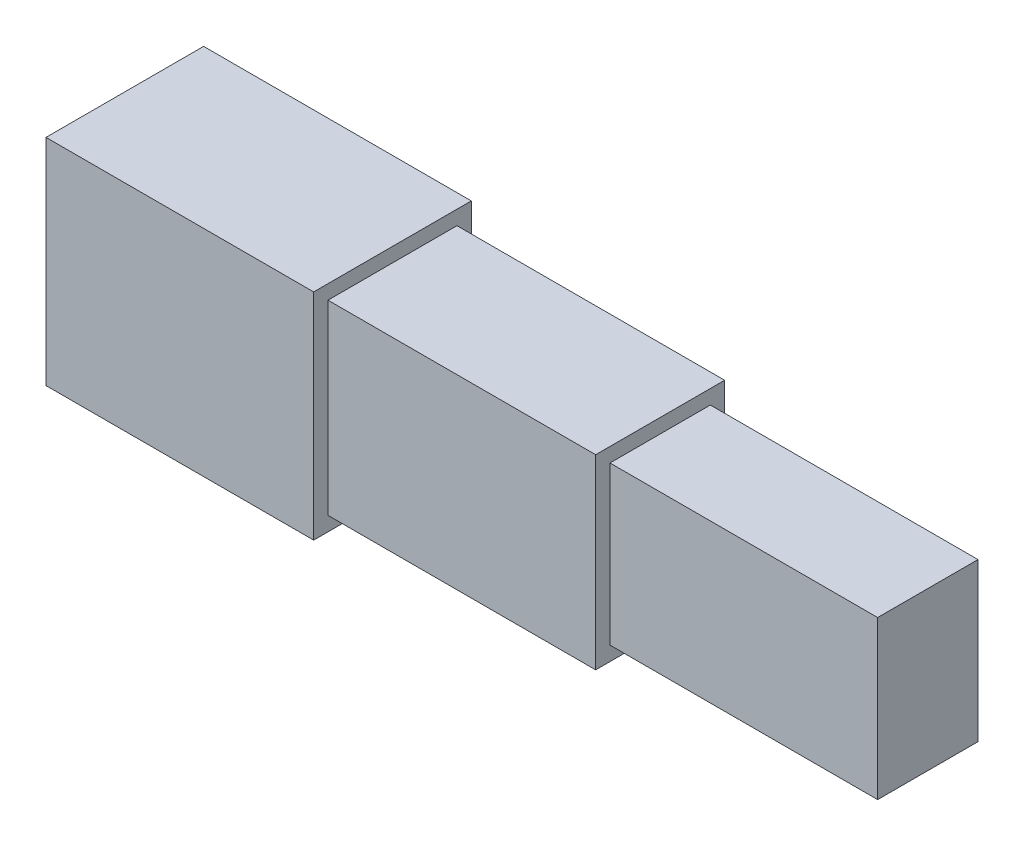
ISO-10303-21;
HEADER;
FILE_DESCRIPTION(('STEP AP214'),'2;1');
FILE_NAME('part.step','',(''),(''),'','','');
FILE_SCHEMA(('AUTOMOTIVE_DESIGN { 1 0 10303 214 1 1 1 1 }'));
ENDSEC;
DATA;
#1=APPLICATION_CONTEXT('core data for automotive mechanical design processes');
#2=APPLICATION_PROTOCOL_DEFINITION('international standard','automotive_design',2000,#1);
#3=PRODUCT_CONTEXT('',#1,'mechanical');
#4=PRODUCT('Part','Part','',(#3));
#5=PRODUCT_RELATED_PRODUCT_CATEGORY('part','',(#4));
#6=PRODUCT_DEFINITION_FORMATION('','',#4);
#7=PRODUCT_DEFINITION_CONTEXT('part definition',#1,'design');
#8=PRODUCT_DEFINITION('design','',#6,#7);
#9=PRODUCT_DEFINITION_SHAPE('','',#8);
#10=(LENGTH_UNIT() NAMED_UNIT(*) SI_UNIT(.MILLI.,.METRE.));
#11=(NAMED_UNIT(*) PLANE_ANGLE_UNIT() SI_UNIT($,.RADIAN.));
#12=(NAMED_UNIT(*) SI_UNIT($,.STERADIAN.) SOLID_ANGLE_UNIT());
#13=UNCERTAINTY_MEASURE_WITH_UNIT(LENGTH_MEASURE(1.E-05),#10,'distance_accuracy_value','');
#14=(GEOMETRIC_REPRESENTATION_CONTEXT(3) GLOBAL_UNCERTAINTY_ASSIGNED_CONTEXT((#13)) GLOBAL_UNIT_ASSIGNED_CONTEXT((#10,
#11,#12)) REPRESENTATION_CONTEXT('',''));
#15=CARTESIAN_POINT('',(0.,0.,0.));
#16=DIRECTION('',(0.,0.,1.));
#17=DIRECTION('',(1.,0.,0.));
#18=AXIS2_PLACEMENT_3D('',#15,#16,#17);
#19=CARTESIAN_POINT('',(1866.66666666667,0.,0.));
#20=DIRECTION('',(-1.,0.,0.));
#21=DIRECTION('',(0.,0.,1.));
#22=AXIS2_PLACEMENT_3D('',#19,#20,#21);
#23=PLANE('',#22);
#24=DIRECTION('',(0.,1.,0.));
#25=VECTOR('',#24,1.);
#26=CARTESIAN_POINT('',(1866.66666666667,-324.9,-224.9));
#27=LINE('',#26,#25);
#28=CARTESIAN_POINT('',(1866.66666666667,-324.9,-224.9));
#29=VERTEX_POINT('',#28);
#30=CARTESIAN_POINT('',(1866.66666666667,324.9,-224.9));
#31=VERTEX_POINT('',#30);
#32=EDGE_CURVE('E167',#29,#31,#27,.T.);
#33=ORIENTED_EDGE('',*,*,#32,.T.);
#34=DIRECTION('',(0.,0.,1.));
#35=VECTOR('',#34,1.);
#36=CARTESIAN_POINT('',(1866.66666666667,324.9,224.9));
#37=LINE('',#36,#35);
#38=CARTESIAN_POINT('',(1866.66666666667,324.9,224.9));
#39=VERTEX_POINT('',#38);
#40=EDGE_CURVE('E171',#31,#39,#37,.T.);
#41=ORIENTED_EDGE('',*,*,#40,.T.);
#42=DIRECTION('',(0.,-1.,0.));
#43=VECTOR('',#42,1.);
#44=CARTESIAN_POINT('',(1866.66666666667,-324.9,224.9));
#45=LINE('',#44,#43);
#46=CARTESIAN_POINT('',(1866.66666666667,-324.9,224.9));
#47=VERTEX_POINT('',#46);
#48=EDGE_CURVE('E175',#39,#47,#45,.T.);
#49=ORIENTED_EDGE('',*,*,#48,.T.);
#50=DIRECTION('',(0.,0.,-1.));
#51=VECTOR('',#50,1.);
#52=CARTESIAN_POINT('',(1866.66666666667,-324.9,224.9));
#53=LINE('',#52,#51);
#54=EDGE_CURVE('E178',#47,#29,#53,.T.);
#55=ORIENTED_EDGE('',*,*,#54,.T.);
#56=EDGE_LOOP('',(#33,#41,#49,#55));
#57=FACE_BOUND('',#56,.T.);
#58=DIRECTION('',(0.,1.,0.));
#59=VECTOR('',#58,1.);
#60=CARTESIAN_POINT('',(1866.66666666667,-274.9845,-174.9845));
#61=LINE('',#60,#59);
#62=CARTESIAN_POINT('',(1866.66666666667,-274.9845,-174.9845));
#63=VERTEX_POINT('',#62);
#64=CARTESIAN_POINT('',(1866.66666666667,274.9845,-174.9845));
#65=VERTEX_POINT('',#64);
#66=EDGE_CURVE('E59',#63,#65,#61,.T.);
#67=ORIENTED_EDGE('',*,*,#66,.F.);
#68=DIRECTION('',(0.,0.,-1.));
#69=VECTOR('',#68,1.);
#70=CARTESIAN_POINT('',(1866.66666666667,-274.9845,174.9845));
#71=LINE('',#70,#69);
#72=CARTESIAN_POINT('',(1866.66666666667,-274.9845,174.9845));
#73=VERTEX_POINT('',#72);
#74=EDGE_CURVE('E63',#73,#63,#71,.T.);
#75=ORIENTED_EDGE('',*,*,#74,.F.);
#76=DIRECTION('',(0.,-1.,0.));
#77=VECTOR('',#76,1.);
#78=CARTESIAN_POINT('',(1866.66666666667,-274.9845,174.9845));
#79=LINE('',#78,#77);
#80=CARTESIAN_POINT('',(1866.66666666667,274.9845,174.9845));
#81=VERTEX_POINT('',#80);
#82=EDGE_CURVE('E439',#81,#73,#79,.T.);
#83=ORIENTED_EDGE('',*,*,#82,.F.);
#84=DIRECTION('',(0.,0.,1.));
#85=VECTOR('',#84,1.);
#86=CARTESIAN_POINT('',(1866.66666666667,274.9845,174.9845));
#87=LINE('',#86,#85);
#88=EDGE_CURVE('E449',#65,#81,#87,.T.);
#89=ORIENTED_EDGE('',*,*,#88,.F.);
#90=EDGE_LOOP('',(#67,#75,#83,#89));
#91=FACE_BOUND('',#90,.T.);
#92=ADVANCED_FACE('F43',(#57,#91),#23,.F.);
#93=CARTESIAN_POINT('',(933.333333333333,0.,0.));
#94=DIRECTION('',(-1.,0.,0.));
#95=DIRECTION('',(0.,0.,1.));
#96=AXIS2_PLACEMENT_3D('',#93,#94,#95);
#97=PLANE('',#96);
#98=DIRECTION('',(0.,1.,0.));
#99=VECTOR('',#98,1.);
#100=CARTESIAN_POINT('',(933.333333333333,-374.8155,-274.8155));
#101=LINE('',#100,#99);
#102=CARTESIAN_POINT('',(933.333333333333,-374.8155,-274.8155));
#103=VERTEX_POINT('',#102);
#104=CARTESIAN_POINT('',(933.333333333333,374.8155,-274.8155));
#105=VERTEX_POINT('',#104);
#106=EDGE_CURVE('E208',#103,#105,#101,.T.);
#107=ORIENTED_EDGE('',*,*,#106,.T.);
#108=DIRECTION('',(0.,0.,1.));
#109=VECTOR('',#108,1.);
#110=CARTESIAN_POINT('',(933.333333333333,374.8155,274.8155));
#111=LINE('',#110,#109);
#112=CARTESIAN_POINT('',(933.333333333333,374.8155,274.8155));
#113=VERTEX_POINT('',#112);
#114=EDGE_CURVE('E212',#105,#113,#111,.T.);
#115=ORIENTED_EDGE('',*,*,#114,.T.);
#116=DIRECTION('',(0.,-1.,0.));
#117=VECTOR('',#116,1.);
#118=CARTESIAN_POINT('',(933.333333333333,-374.8155,274.8155));
#119=LINE('',#118,#117);
#120=CARTESIAN_POINT('',(933.333333333333,-374.8155,274.8155));
#121=VERTEX_POINT('',#120);
#122=EDGE_CURVE('E216',#113,#121,#119,.T.);
#123=ORIENTED_EDGE('',*,*,#122,.T.);
#124=DIRECTION('',(0.,0.,-1.));
#125=VECTOR('',#124,1.);
#126=CARTESIAN_POINT('',(933.333333333333,-374.8155,274.8155));
#127=LINE('',#126,#125);
#128=EDGE_CURVE('E219',#121,#103,#127,.T.);
#129=ORIENTED_EDGE('',*,*,#128,.T.);
#130=EDGE_LOOP('',(#107,#115,#123,#129));
#131=FACE_BOUND('',#130,.T.);
#132=DIRECTION('',(0.,1.,0.));
#133=VECTOR('',#132,1.);
#134=CARTESIAN_POINT('',(933.333333333333,-324.9,-224.9));
#135=LINE('',#134,#133);
#136=CARTESIAN_POINT('',(933.333333333333,-324.9,-224.9));
#137=VERTEX_POINT('',#136);
#138=CARTESIAN_POINT('',(933.333333333333,324.9,-224.9));
#139=VERTEX_POINT('',#138);
#140=EDGE_CURVE('E156',#137,#139,#135,.T.);
#141=ORIENTED_EDGE('',*,*,#140,.F.);
#142=DIRECTION('',(0.,0.,-1.));
#143=VECTOR('',#142,1.);
#144=CARTESIAN_POINT('',(933.333333333333,-324.9,224.9));
#145=LINE('',#144,#143);
#146=CARTESIAN_POINT('',(933.333333333333,-324.9,224.9));
#147=VERTEX_POINT('',#146);
#148=EDGE_CURVE('E172',#147,#137,#145,.T.);
#149=ORIENTED_EDGE('',*,*,#148,.F.);
#150=DIRECTION('',(0.,-1.,0.));
#151=VECTOR('',#150,1.);
#152=CARTESIAN_POINT('',(933.333333333333,-324.9,224.9));
#153=LINE('',#152,#151);
#154=CARTESIAN_POINT('',(933.333333333333,324.9,224.9));
#155=VERTEX_POINT('',#154);
#156=EDGE_CURVE('E185',#155,#147,#153,.T.);
#157=ORIENTED_EDGE('',*,*,#156,.F.);
#158=DIRECTION('',(0.,0.,1.));
#159=VECTOR('',#158,1.);
#160=CARTESIAN_POINT('',(933.333333333333,324.9,224.9));
#161=LINE('',#160,#159);
#162=EDGE_CURVE('E161',#139,#155,#161,.T.);
#163=ORIENTED_EDGE('',*,*,#162,.F.);
#164=EDGE_LOOP('',(#141,#149,#157,#163));
#165=FACE_BOUND('',#164,.T.);
#166=ADVANCED_FACE('F261',(#131,#165),#97,.F.);
#167=CARTESIAN_POINT('',(933.333333333333,-374.8155,-274.8155));
#168=DIRECTION('',(0.,0.,1.));
#169=DIRECTION('',(1.,0.,0.));
#170=AXIS2_PLACEMENT_3D('',#167,#168,#169);
#171=PLANE('',#170);
#172=DIRECTION('',(0.,1.,0.));
#173=VECTOR('',#172,1.);
#174=CARTESIAN_POINT('',(0.,-374.8155,-274.8155));
#175=LINE('',#174,#173);
#176=CARTESIAN_POINT('',(0.,-374.8155,-274.8155));
#177=VERTEX_POINT('',#176);
#178=CARTESIAN_POINT('',(0.,374.8155,-274.8155));
#179=VERTEX_POINT('',#178);
#180=EDGE_CURVE('E207',#177,#179,#175,.T.);
#181=ORIENTED_EDGE('',*,*,#180,.T.);
#182=DIRECTION('',(-1.,0.,0.));
#183=VECTOR('',#182,1.);
#184=CARTESIAN_POINT('',(933.333333333333,374.8155,-274.8155));
#185=LINE('',#184,#183);
#186=EDGE_CURVE('E11',#105,#179,#185,.T.);
#187=ORIENTED_EDGE('',*,*,#186,.F.);
#188=ORIENTED_EDGE('',*,*,#106,.F.);
#189=DIRECTION('',(-1.,0.,0.));
#190=VECTOR('',#189,1.);
#191=CARTESIAN_POINT('',(933.333333333333,-374.8155,-274.8155));
#192=LINE('',#191,#190);
#193=EDGE_CURVE('E222',#103,#177,#192,.T.);
#194=ORIENTED_EDGE('',*,*,#193,.T.);
#195=EDGE_LOOP('',(#181,#187,#188,#194));
#196=FACE_BOUND('',#195,.T.);
#197=ADVANCED_FACE('F45',(#196),#171,.F.);
#198=CARTESIAN_POINT('',(933.333333333333,374.8155,274.8155));
#199=DIRECTION('',(0.,-1.,0.));
#200=DIRECTION('',(0.,0.,-1.));
#201=AXIS2_PLACEMENT_3D('',#198,#199,#200);
#202=PLANE('',#201);
#203=DIRECTION('',(0.,0.,1.));
#204=VECTOR('',#203,1.);
#205=CARTESIAN_POINT('',(0.,374.8155,274.8155));
#206=LINE('',#205,#204);
#207=CARTESIAN_POINT('',(0.,374.8155,274.8155));
#208=VERTEX_POINT('',#207);
#209=EDGE_CURVE('E226',#179,#208,#206,.T.);
#210=ORIENTED_EDGE('',*,*,#209,.T.);
#211=DIRECTION('',(-1.,0.,0.));
#212=VECTOR('',#211,1.);
#213=CARTESIAN_POINT('',(933.333333333333,374.8155,274.8155));
#214=LINE('',#213,#212);
#215=EDGE_CURVE('E52',#113,#208,#214,.T.);
#216=ORIENTED_EDGE('',*,*,#215,.F.);
#217=ORIENTED_EDGE('',*,*,#114,.F.);
#218=ORIENTED_EDGE('',*,*,#186,.T.);
#219=EDGE_LOOP('',(#210,#216,#217,#218));
#220=FACE_BOUND('',#219,.T.);
#221=ADVANCED_FACE('F263',(#220),#202,.F.);
#222=CARTESIAN_POINT('',(933.333333333333,-374.8155,274.8155));
#223=DIRECTION('',(0.,0.,-1.));
#224=DIRECTION('',(-1.,0.,0.));
#225=AXIS2_PLACEMENT_3D('',#222,#223,#224);
#226=PLANE('',#225);
#227=DIRECTION('',(0.,-1.,0.));
#228=VECTOR('',#227,1.);
#229=CARTESIAN_POINT('',(0.,-374.8155,274.8155));
#230=LINE('',#229,#228);
#231=CARTESIAN_POINT('',(0.,-374.8155,274.8155));
#232=VERTEX_POINT('',#231);
#233=EDGE_CURVE('E229',#208,#232,#230,.T.);
#234=ORIENTED_EDGE('',*,*,#233,.T.);
#235=DIRECTION('',(-1.,0.,0.));
#236=VECTOR('',#235,1.);
#237=CARTESIAN_POINT('',(933.333333333333,-374.8155,274.8155));
#238=LINE('',#237,#236);
#239=EDGE_CURVE('E237',#121,#232,#238,.T.);
#240=ORIENTED_EDGE('',*,*,#239,.F.);
#241=ORIENTED_EDGE('',*,*,#122,.F.);
#242=ORIENTED_EDGE('',*,*,#215,.T.);
#243=EDGE_LOOP('',(#234,#240,#241,#242));
#244=FACE_BOUND('',#243,.T.);
#245=ADVANCED_FACE('F246',(#244),#226,.F.);
#246=CARTESIAN_POINT('',(933.333333333333,-374.8155,274.8155));
#247=DIRECTION('',(0.,1.,0.));
#248=DIRECTION('',(0.,0.,1.));
#249=AXIS2_PLACEMENT_3D('',#246,#247,#248);
#250=PLANE('',#249);
#251=DIRECTION('',(0.,0.,-1.));
#252=VECTOR('',#251,1.);
#253=CARTESIAN_POINT('',(0.,-374.8155,274.8155));
#254=LINE('',#253,#252);
#255=EDGE_CURVE('E213',#232,#177,#254,.T.);
#256=ORIENTED_EDGE('',*,*,#255,.T.);
#257=ORIENTED_EDGE('',*,*,#193,.F.);
#258=ORIENTED_EDGE('',*,*,#128,.F.);
#259=ORIENTED_EDGE('',*,*,#239,.T.);
#260=EDGE_LOOP('',(#256,#257,#258,#259));
#261=FACE_BOUND('',#260,.T.);
#262=ADVANCED_FACE('F255',(#261),#250,.F.);
#263=CARTESIAN_POINT('',(0.,0.,0.));
#264=DIRECTION('',(-1.,0.,0.));
#265=DIRECTION('',(0.,0.,1.));
#266=AXIS2_PLACEMENT_3D('',#263,#264,#265);
#267=PLANE('',#266);
#268=ORIENTED_EDGE('',*,*,#180,.F.);
#269=ORIENTED_EDGE('',*,*,#255,.F.);
#270=ORIENTED_EDGE('',*,*,#233,.F.);
#271=ORIENTED_EDGE('',*,*,#209,.F.);
#272=EDGE_LOOP('',(#268,#269,#270,#271));
#273=FACE_BOUND('',#272,.T.);
#274=ADVANCED_FACE('F252',(#273),#267,.T.);
#275=CARTESIAN_POINT('',(1866.66666666667,-324.9,-224.9));
#276=DIRECTION('',(0.,0.,1.));
#277=DIRECTION('',(1.,0.,0.));
#278=AXIS2_PLACEMENT_3D('',#275,#276,#277);
#279=PLANE('',#278);
#280=ORIENTED_EDGE('',*,*,#140,.T.);
#281=DIRECTION('',(-1.,0.,0.));
#282=VECTOR('',#281,1.);
#283=CARTESIAN_POINT('',(1866.66666666667,324.9,-224.9));
#284=LINE('',#283,#282);
#285=EDGE_CURVE('E203',#31,#139,#284,.T.);
#286=ORIENTED_EDGE('',*,*,#285,.F.);
#287=ORIENTED_EDGE('',*,*,#32,.F.);
#288=DIRECTION('',(-1.,0.,0.));
#289=VECTOR('',#288,1.);
#290=CARTESIAN_POINT('',(1866.66666666667,-324.9,-224.9));
#291=LINE('',#290,#289);
#292=EDGE_CURVE('E180',#29,#137,#291,.T.);
#293=ORIENTED_EDGE('',*,*,#292,.T.);
#294=EDGE_LOOP('',(#280,#286,#287,#293));
#295=FACE_BOUND('',#294,.T.);
#296=ADVANCED_FACE('F291',(#295),#279,.F.);
#297=CARTESIAN_POINT('',(1866.66666666667,324.9,224.9));
#298=DIRECTION('',(0.,-1.,0.));
#299=DIRECTION('',(0.,0.,-1.));
#300=AXIS2_PLACEMENT_3D('',#297,#298,#299);
#301=PLANE('',#300);
#302=ORIENTED_EDGE('',*,*,#162,.T.);
#303=DIRECTION('',(-1.,0.,0.));
#304=VECTOR('',#303,1.);
#305=CARTESIAN_POINT('',(1866.66666666667,324.9,224.9));
#306=LINE('',#305,#304);
#307=EDGE_CURVE('E199',#39,#155,#306,.T.);
#308=ORIENTED_EDGE('',*,*,#307,.F.);
#309=ORIENTED_EDGE('',*,*,#40,.F.);
#310=ORIENTED_EDGE('',*,*,#285,.T.);
#311=EDGE_LOOP('',(#302,#308,#309,#310));
#312=FACE_BOUND('',#311,.T.);
#313=ADVANCED_FACE('F287',(#312),#301,.F.);
#314=CARTESIAN_POINT('',(1866.66666666667,-324.9,224.9));
#315=DIRECTION('',(0.,0.,-1.));
#316=DIRECTION('',(-1.,0.,0.));
#317=AXIS2_PLACEMENT_3D('',#314,#315,#316);
#318=PLANE('',#317);
#319=ORIENTED_EDGE('',*,*,#156,.T.);
#320=DIRECTION('',(-1.,0.,0.));
#321=VECTOR('',#320,1.);
#322=CARTESIAN_POINT('',(1866.66666666667,-324.9,224.9));
#323=LINE('',#322,#321);
#324=EDGE_CURVE('E195',#47,#147,#323,.T.);
#325=ORIENTED_EDGE('',*,*,#324,.F.);
#326=ORIENTED_EDGE('',*,*,#48,.F.);
#327=ORIENTED_EDGE('',*,*,#307,.T.);
#328=EDGE_LOOP('',(#319,#325,#326,#327));
#329=FACE_BOUND('',#328,.T.);
#330=ADVANCED_FACE('F283',(#329),#318,.F.);
#331=CARTESIAN_POINT('',(1866.66666666667,-324.9,224.9));
#332=DIRECTION('',(0.,1.,0.));
#333=DIRECTION('',(0.,0.,1.));
#334=AXIS2_PLACEMENT_3D('',#331,#332,#333);
#335=PLANE('',#334);
#336=ORIENTED_EDGE('',*,*,#148,.T.);
#337=ORIENTED_EDGE('',*,*,#292,.F.);
#338=ORIENTED_EDGE('',*,*,#54,.F.);
#339=ORIENTED_EDGE('',*,*,#324,.T.);
#340=EDGE_LOOP('',(#336,#337,#338,#339));
#341=FACE_BOUND('',#340,.T.);
#342=ADVANCED_FACE('F280',(#341),#335,.F.);
#343=CARTESIAN_POINT('',(2800.,-274.9845,-174.9845));
#344=DIRECTION('',(0.,0.,1.));
#345=DIRECTION('',(1.,0.,0.));
#346=AXIS2_PLACEMENT_3D('',#343,#344,#345);
#347=PLANE('',#346);
#348=ORIENTED_EDGE('',*,*,#66,.T.);
#349=DIRECTION('',(-1.,0.,0.));
#350=VECTOR('',#349,1.);
#351=CARTESIAN_POINT('',(2800.,274.9845,-174.9845));
#352=LINE('',#351,#350);
#353=CARTESIAN_POINT('',(2800.,274.9845,-174.9845));
#354=VERTEX_POINT('',#353);
#355=EDGE_CURVE('E136',#354,#65,#352,.T.);
#356=ORIENTED_EDGE('',*,*,#355,.F.);
#357=DIRECTION('',(0.,1.,0.));
#358=VECTOR('',#357,1.);
#359=CARTESIAN_POINT('',(2800.,-274.9845,-174.9845));
#360=LINE('',#359,#358);
#361=CARTESIAN_POINT('',(2800.,-274.9845,-174.9845));
#362=VERTEX_POINT('',#361);
#363=EDGE_CURVE('E143',#362,#354,#360,.T.);
#364=ORIENTED_EDGE('',*,*,#363,.F.);
#365=DIRECTION('',(-1.,0.,0.));
#366=VECTOR('',#365,1.);
#367=CARTESIAN_POINT('',(2800.,-274.9845,-174.9845));
#368=LINE('',#367,#366);
#369=EDGE_CURVE('E436',#362,#63,#368,.T.);
#370=ORIENTED_EDGE('',*,*,#369,.T.);
#371=EDGE_LOOP('',(#348,#356,#364,#370));
#372=FACE_BOUND('',#371,.T.);
#373=ADVANCED_FACE('F154',(#372),#347,.F.);
#374=CARTESIAN_POINT('',(2800.,274.9845,174.9845));
#375=DIRECTION('',(0.,-1.,0.));
#376=DIRECTION('',(0.,0.,-1.));
#377=AXIS2_PLACEMENT_3D('',#374,#375,#376);
#378=PLANE('',#377);
#379=ORIENTED_EDGE('',*,*,#88,.T.);
#380=DIRECTION('',(-1.,0.,0.));
#381=VECTOR('',#380,1.);
#382=CARTESIAN_POINT('',(2800.,274.9845,174.9845));
#383=LINE('',#382,#381);
#384=CARTESIAN_POINT('',(2800.,274.9845,174.9845));
#385=VERTEX_POINT('',#384);
#386=EDGE_CURVE('E138',#385,#81,#383,.T.);
#387=ORIENTED_EDGE('',*,*,#386,.F.);
#388=DIRECTION('',(0.,0.,1.));
#389=VECTOR('',#388,1.);
#390=CARTESIAN_POINT('',(2800.,274.9845,174.9845));
#391=LINE('',#390,#389);
#392=EDGE_CURVE('E131',#354,#385,#391,.T.);
#393=ORIENTED_EDGE('',*,*,#392,.F.);
#394=ORIENTED_EDGE('',*,*,#355,.T.);
#395=EDGE_LOOP('',(#379,#387,#393,#394));
#396=FACE_BOUND('',#395,.T.);
#397=ADVANCED_FACE('F134',(#396),#378,.F.);
#398=CARTESIAN_POINT('',(2800.,-274.9845,174.9845));
#399=DIRECTION('',(0.,0.,-1.));
#400=DIRECTION('',(-1.,0.,0.));
#401=AXIS2_PLACEMENT_3D('',#398,#399,#400);
#402=PLANE('',#401);
#403=ORIENTED_EDGE('',*,*,#82,.T.);
#404=DIRECTION('',(-1.,0.,0.));
#405=VECTOR('',#404,1.);
#406=CARTESIAN_POINT('',(2800.,-274.9845,174.9845));
#407=LINE('',#406,#405);
#408=CARTESIAN_POINT('',(2800.,-274.9845,174.9845));
#409=VERTEX_POINT('',#408);
#410=EDGE_CURVE('E163',#409,#73,#407,.T.);
#411=ORIENTED_EDGE('',*,*,#410,.F.);
#412=DIRECTION('',(0.,-1.,0.));
#413=VECTOR('',#412,1.);
#414=CARTESIAN_POINT('',(2800.,-274.9845,174.9845));
#415=LINE('',#414,#413);
#416=EDGE_CURVE('E142',#385,#409,#415,.T.);
#417=ORIENTED_EDGE('',*,*,#416,.F.);
#418=ORIENTED_EDGE('',*,*,#386,.T.);
#419=EDGE_LOOP('',(#403,#411,#417,#418));
#420=FACE_BOUND('',#419,.T.);
#421=ADVANCED_FACE('F335',(#420),#402,.F.);
#422=CARTESIAN_POINT('',(2800.,-274.9845,174.9845));
#423=DIRECTION('',(0.,1.,0.));
#424=DIRECTION('',(0.,0.,1.));
#425=AXIS2_PLACEMENT_3D('',#422,#423,#424);
#426=PLANE('',#425);
#427=ORIENTED_EDGE('',*,*,#74,.T.);
#428=ORIENTED_EDGE('',*,*,#369,.F.);
#429=DIRECTION('',(0.,0.,-1.));
#430=VECTOR('',#429,1.);
#431=CARTESIAN_POINT('',(2800.,-274.9845,174.9845));
#432=LINE('',#431,#430);
#433=EDGE_CURVE('E148',#409,#362,#432,.T.);
#434=ORIENTED_EDGE('',*,*,#433,.F.);
#435=ORIENTED_EDGE('',*,*,#410,.T.);
#436=EDGE_LOOP('',(#427,#428,#434,#435));
#437=FACE_BOUND('',#436,.T.);
#438=ADVANCED_FACE('F341',(#437),#426,.F.);
#439=CARTESIAN_POINT('',(2800.,0.,0.));
#440=DIRECTION('',(-1.,0.,0.));
#441=DIRECTION('',(0.,0.,1.));
#442=AXIS2_PLACEMENT_3D('',#439,#440,#441);
#443=PLANE('',#442);
#444=ORIENTED_EDGE('',*,*,#363,.T.);
#445=ORIENTED_EDGE('',*,*,#392,.T.);
#446=ORIENTED_EDGE('',*,*,#416,.T.);
#447=ORIENTED_EDGE('',*,*,#433,.T.);
#448=EDGE_LOOP('',(#444,#445,#446,#447));
#449=FACE_BOUND('',#448,.T.);
#450=ADVANCED_FACE('F146',(#449),#443,.F.);
#451=CLOSED_SHELL('',(#92,#166,#197,#221,#245,#262,#274,#296,#313,#330,#342,#373,#397,#421,#438,#450));
#452=MANIFOLD_SOLID_BREP('B2',#451);
#453=ADVANCED_BREP_SHAPE_REPRESENTATION('',(#18,#452),#14);
#454=SHAPE_DEFINITION_REPRESENTATION(#9,#453);
ENDSEC;
END-ISO-10303-21;
